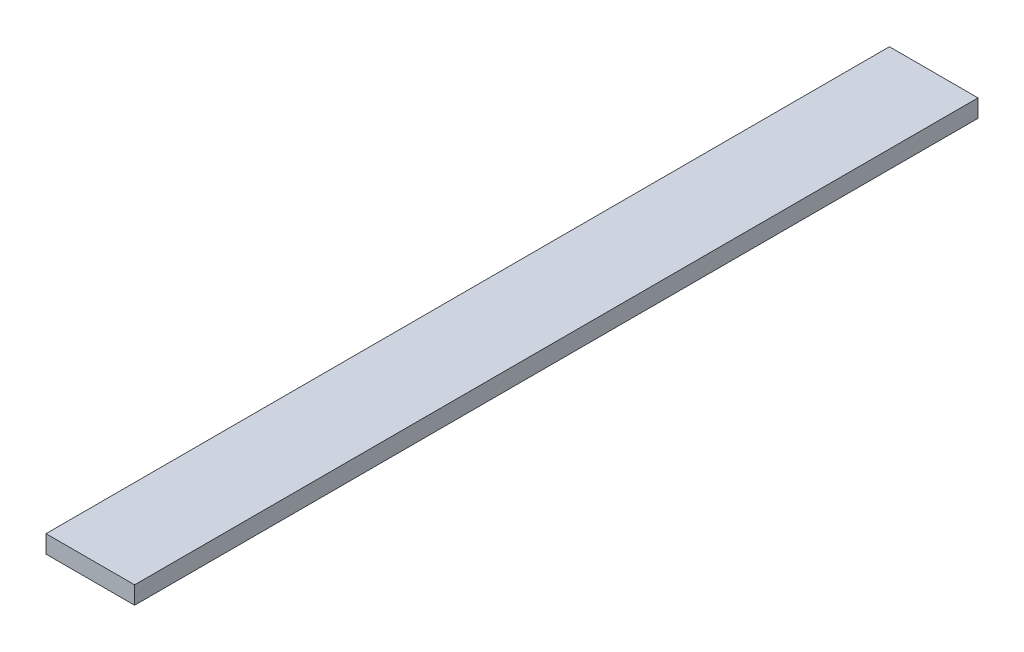
ISO-10303-21;
HEADER;
FILE_DESCRIPTION(('STEP AP214'),'2;1');
FILE_NAME('part.step','',(''),(''),'','','');
FILE_SCHEMA(('AUTOMOTIVE_DESIGN { 1 0 10303 214 1 1 1 1 }'));
ENDSEC;
DATA;
#1=APPLICATION_CONTEXT('core data for automotive mechanical design processes');
#2=APPLICATION_PROTOCOL_DEFINITION('international standard','automotive_design',2000,#1);
#3=PRODUCT_CONTEXT('',#1,'mechanical');
#4=PRODUCT('Part','Part','',(#3));
#5=PRODUCT_RELATED_PRODUCT_CATEGORY('part','',(#4));
#6=PRODUCT_DEFINITION_FORMATION('','',#4);
#7=PRODUCT_DEFINITION_CONTEXT('part definition',#1,'design');
#8=PRODUCT_DEFINITION('design','',#6,#7);
#9=PRODUCT_DEFINITION_SHAPE('','',#8);
#10=(LENGTH_UNIT() NAMED_UNIT(*) SI_UNIT(.MILLI.,.METRE.));
#11=(NAMED_UNIT(*) PLANE_ANGLE_UNIT() SI_UNIT($,.RADIAN.));
#12=(NAMED_UNIT(*) SI_UNIT($,.STERADIAN.) SOLID_ANGLE_UNIT());
#13=UNCERTAINTY_MEASURE_WITH_UNIT(LENGTH_MEASURE(1.E-05),#10,'distance_accuracy_value','');
#14=(GEOMETRIC_REPRESENTATION_CONTEXT(3) GLOBAL_UNCERTAINTY_ASSIGNED_CONTEXT((#13)) GLOBAL_UNIT_ASSIGNED_CONTEXT((#10,
#11,#12)) REPRESENTATION_CONTEXT('',''));
#15=CARTESIAN_POINT('',(0.,0.,0.));
#16=DIRECTION('',(0.,0.,1.));
#17=DIRECTION('',(1.,0.,0.));
#18=AXIS2_PLACEMENT_3D('',#15,#16,#17);
#19=CARTESIAN_POINT('',(0.,2.02999999999,0.));
#20=DIRECTION('',(0.,1.,0.));
#21=DIRECTION('',(0.,0.,1.));
#22=AXIS2_PLACEMENT_3D('',#19,#20,#21);
#23=PLANE('',#22);
#24=DIRECTION('',(0.,0.,1.));
#25=VECTOR('',#24,1.);
#26=CARTESIAN_POINT('',(2.875,2.02999999999,0.195));
#27=LINE('',#26,#25);
#28=CARTESIAN_POINT('',(2.875,2.02999999999,0.195));
#29=VERTEX_POINT('',#28);
#30=CARTESIAN_POINT('',(2.875,2.02999999999,2.575));
#31=VERTEX_POINT('',#30);
#32=EDGE_CURVE('E80',#29,#31,#27,.T.);
#33=ORIENTED_EDGE('',*,*,#32,.T.);
#34=DIRECTION('',(-1.,0.,0.));
#35=VECTOR('',#34,1.);
#36=CARTESIAN_POINT('',(2.875,2.02999999999,2.575));
#37=LINE('',#36,#35);
#38=CARTESIAN_POINT('',(2.625,2.02999999999,2.575));
#39=VERTEX_POINT('',#38);
#40=EDGE_CURVE('E67',#31,#39,#37,.T.);
#41=ORIENTED_EDGE('',*,*,#40,.T.);
#42=DIRECTION('',(0.,0.,1.));
#43=VECTOR('',#42,1.);
#44=CARTESIAN_POINT('',(2.625,2.02999999999,0.195));
#45=LINE('',#44,#43);
#46=CARTESIAN_POINT('',(2.625,2.02999999999,0.195));
#47=VERTEX_POINT('',#46);
#48=EDGE_CURVE('E54',#39,#47,#45,.F.);
#49=ORIENTED_EDGE('',*,*,#48,.T.);
#50=DIRECTION('',(1.,0.,0.));
#51=VECTOR('',#50,1.);
#52=CARTESIAN_POINT('',(2.875,2.02999999999,0.195));
#53=LINE('',#52,#51);
#54=EDGE_CURVE('E19',#47,#29,#53,.T.);
#55=ORIENTED_EDGE('',*,*,#54,.T.);
#56=EDGE_LOOP('',(#33,#41,#49,#55));
#57=FACE_BOUND('',#56,.T.);
#58=ADVANCED_FACE('F16',(#57),#23,.F.);
#59=CARTESIAN_POINT('',(2.875,2.07999999999,0.195));
#60=DIRECTION('',(0.,0.,1.));
#61=DIRECTION('',(1.,0.,0.));
#62=AXIS2_PLACEMENT_3D('',#59,#60,#61);
#63=PLANE('',#62);
#64=DIRECTION('',(0.,1.,0.));
#65=VECTOR('',#64,1.);
#66=CARTESIAN_POINT('',(2.625,2.07999999999,0.195));
#67=LINE('',#66,#65);
#68=CARTESIAN_POINT('',(2.625,2.07999999999,0.195));
#69=VERTEX_POINT('',#68);
#70=EDGE_CURVE('E60',#47,#69,#67,.T.);
#71=ORIENTED_EDGE('',*,*,#70,.T.);
#72=DIRECTION('',(1.,0.,0.));
#73=VECTOR('',#72,1.);
#74=CARTESIAN_POINT('',(0.,2.07999999999,0.195));
#75=LINE('',#74,#73);
#76=CARTESIAN_POINT('',(2.875,2.07999999999,0.195));
#77=VERTEX_POINT('',#76);
#78=EDGE_CURVE('E82',#77,#69,#75,.F.);
#79=ORIENTED_EDGE('',*,*,#78,.F.);
#80=DIRECTION('',(0.,-1.,0.));
#81=VECTOR('',#80,1.);
#82=CARTESIAN_POINT('',(2.875,2.07999999999,0.195));
#83=LINE('',#82,#81);
#84=EDGE_CURVE('E63',#77,#29,#83,.T.);
#85=ORIENTED_EDGE('',*,*,#84,.T.);
#86=ORIENTED_EDGE('',*,*,#54,.F.);
#87=EDGE_LOOP('',(#71,#79,#85,#86));
#88=FACE_BOUND('',#87,.T.);
#89=ADVANCED_FACE('F59',(#88),#63,.F.);
#90=CARTESIAN_POINT('',(2.625,2.07999999999,0.195));
#91=DIRECTION('',(1.,0.,0.));
#92=DIRECTION('',(0.,1.,0.));
#93=AXIS2_PLACEMENT_3D('',#90,#91,#92);
#94=PLANE('',#93);
#95=DIRECTION('',(0.,1.,0.));
#96=VECTOR('',#95,1.);
#97=CARTESIAN_POINT('',(2.625,2.07999999999,2.575));
#98=LINE('',#97,#96);
#99=CARTESIAN_POINT('',(2.625,2.07999999999,2.575));
#100=VERTEX_POINT('',#99);
#101=EDGE_CURVE('E69',#39,#100,#98,.T.);
#102=ORIENTED_EDGE('',*,*,#101,.T.);
#103=DIRECTION('',(0.,0.,1.));
#104=VECTOR('',#103,1.);
#105=CARTESIAN_POINT('',(2.625,2.07999999999,0.));
#106=LINE('',#105,#104);
#107=EDGE_CURVE('E73',#69,#100,#106,.T.);
#108=ORIENTED_EDGE('',*,*,#107,.F.);
#109=ORIENTED_EDGE('',*,*,#70,.F.);
#110=ORIENTED_EDGE('',*,*,#48,.F.);
#111=EDGE_LOOP('',(#102,#108,#109,#110));
#112=FACE_BOUND('',#111,.T.);
#113=ADVANCED_FACE('F71',(#112),#94,.F.);
#114=CARTESIAN_POINT('',(2.875,2.07999999999,2.575));
#115=DIRECTION('',(0.,0.,-1.));
#116=DIRECTION('',(-1.,0.,0.));
#117=AXIS2_PLACEMENT_3D('',#114,#115,#116);
#118=PLANE('',#117);
#119=DIRECTION('',(0.,-1.,0.));
#120=VECTOR('',#119,1.);
#121=CARTESIAN_POINT('',(2.875,2.07999999999,2.575));
#122=LINE('',#121,#120);
#123=CARTESIAN_POINT('',(2.875,2.07999999999,2.575));
#124=VERTEX_POINT('',#123);
#125=EDGE_CURVE('E34',#31,#124,#122,.F.);
#126=ORIENTED_EDGE('',*,*,#125,.T.);
#127=DIRECTION('',(1.,0.,0.));
#128=VECTOR('',#127,1.);
#129=CARTESIAN_POINT('',(0.,2.07999999999,2.575));
#130=LINE('',#129,#128);
#131=EDGE_CURVE('E25',#100,#124,#130,.T.);
#132=ORIENTED_EDGE('',*,*,#131,.F.);
#133=ORIENTED_EDGE('',*,*,#101,.F.);
#134=ORIENTED_EDGE('',*,*,#40,.F.);
#135=EDGE_LOOP('',(#126,#132,#133,#134));
#136=FACE_BOUND('',#135,.T.);
#137=ADVANCED_FACE('F88',(#136),#118,.F.);
#138=CARTESIAN_POINT('',(2.875,2.07999999999,0.195));
#139=DIRECTION('',(-1.,0.,0.));
#140=DIRECTION('',(0.,-1.,0.));
#141=AXIS2_PLACEMENT_3D('',#138,#139,#140);
#142=PLANE('',#141);
#143=ORIENTED_EDGE('',*,*,#84,.F.);
#144=DIRECTION('',(0.,0.,1.));
#145=VECTOR('',#144,1.);
#146=CARTESIAN_POINT('',(2.875,2.07999999999,0.));
#147=LINE('',#146,#145);
#148=EDGE_CURVE('E11',#124,#77,#147,.F.);
#149=ORIENTED_EDGE('',*,*,#148,.F.);
#150=ORIENTED_EDGE('',*,*,#125,.F.);
#151=ORIENTED_EDGE('',*,*,#32,.F.);
#152=EDGE_LOOP('',(#143,#149,#150,#151));
#153=FACE_BOUND('',#152,.T.);
#154=ADVANCED_FACE('F90',(#153),#142,.F.);
#155=CARTESIAN_POINT('',(0.,2.07999999999,0.));
#156=DIRECTION('',(0.,1.,0.));
#157=DIRECTION('',(0.,0.,1.));
#158=AXIS2_PLACEMENT_3D('',#155,#156,#157);
#159=PLANE('',#158);
#160=ORIENTED_EDGE('',*,*,#131,.T.);
#161=ORIENTED_EDGE('',*,*,#148,.T.);
#162=ORIENTED_EDGE('',*,*,#78,.T.);
#163=ORIENTED_EDGE('',*,*,#107,.T.);
#164=EDGE_LOOP('',(#160,#161,#162,#163));
#165=FACE_BOUND('',#164,.T.);
#166=ADVANCED_FACE('F87',(#165),#159,.T.);
#167=CLOSED_SHELL('',(#58,#89,#113,#137,#154,#166));
#168=MANIFOLD_SOLID_BREP('B1',#167);
#169=ADVANCED_BREP_SHAPE_REPRESENTATION('',(#18,#168),#14);
#170=SHAPE_DEFINITION_REPRESENTATION(#9,#169);
ENDSEC;
END-ISO-10303-21;
